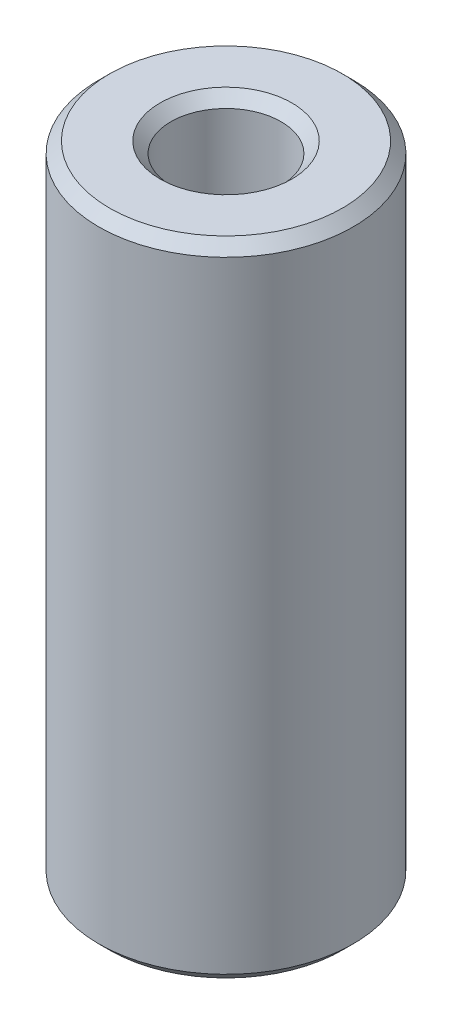
ISO-10303-21;
HEADER;
FILE_DESCRIPTION(('STEP AP214'),'2;1');
FILE_NAME('part.step','',(''),(''),'','','');
FILE_SCHEMA(('AUTOMOTIVE_DESIGN { 1 0 10303 214 1 1 1 1 }'));
ENDSEC;
DATA;
#1=APPLICATION_CONTEXT('core data for automotive mechanical design processes');
#2=APPLICATION_PROTOCOL_DEFINITION('international standard','automotive_design',2000,#1);
#3=PRODUCT_CONTEXT('',#1,'mechanical');
#4=PRODUCT('Part','Part','',(#3));
#5=PRODUCT_RELATED_PRODUCT_CATEGORY('part','',(#4));
#6=PRODUCT_DEFINITION_FORMATION('','',#4);
#7=PRODUCT_DEFINITION_CONTEXT('part definition',#1,'design');
#8=PRODUCT_DEFINITION('design','',#6,#7);
#9=PRODUCT_DEFINITION_SHAPE('','',#8);
#10=(LENGTH_UNIT() NAMED_UNIT(*) SI_UNIT(.MILLI.,.METRE.));
#11=(NAMED_UNIT(*) PLANE_ANGLE_UNIT() SI_UNIT($,.RADIAN.));
#12=(NAMED_UNIT(*) SI_UNIT($,.STERADIAN.) SOLID_ANGLE_UNIT());
#13=UNCERTAINTY_MEASURE_WITH_UNIT(LENGTH_MEASURE(1.E-05),#10,'distance_accuracy_value','');
#14=(GEOMETRIC_REPRESENTATION_CONTEXT(3) GLOBAL_UNCERTAINTY_ASSIGNED_CONTEXT((#13)) GLOBAL_UNIT_ASSIGNED_CONTEXT((#10,
#11,#12)) REPRESENTATION_CONTEXT('',''));
#15=CARTESIAN_POINT('',(0.,0.,0.));
#16=DIRECTION('',(0.,0.,1.));
#17=DIRECTION('',(1.,0.,0.));
#18=AXIS2_PLACEMENT_3D('',#15,#16,#17);
#19=CARTESIAN_POINT('',(0.,88.390727873785,0.));
#20=DIRECTION('',(0.,-1.,0.));
#21=DIRECTION('',(0.,0.,-1.));
#22=AXIS2_PLACEMENT_3D('',#19,#20,#21);
#23=CYLINDRICAL_SURFACE('',#22,17.5);
#24=CARTESIAN_POINT('',(0.,1.48932013609084,0.));
#25=DIRECTION('',(0.,1.,0.));
#26=DIRECTION('',(0.,0.,1.));
#27=AXIS2_PLACEMENT_3D('',#24,#25,#26);
#28=CIRCLE('',#27,17.5);
#29=CARTESIAN_POINT('',(0.,1.48932013609084,17.5));
#30=VERTEX_POINT('',#29);
#31=EDGE_CURVE('E10',#30,#30,#28,.T.);
#32=ORIENTED_EDGE('',*,*,#31,.T.);
#33=EDGE_LOOP('',(#32));
#34=FACE_BOUND('',#33,.T.);
#35=CARTESIAN_POINT('',(0.,86.9014077376941,0.));
#36=DIRECTION('',(0.,1.,0.));
#37=DIRECTION('',(0.,0.,1.));
#38=AXIS2_PLACEMENT_3D('',#35,#36,#37);
#39=CIRCLE('',#38,17.5);
#40=CARTESIAN_POINT('',(0.,86.9014077376941,17.5));
#41=VERTEX_POINT('',#40);
#42=EDGE_CURVE('E50',#41,#41,#39,.F.);
#43=ORIENTED_EDGE('',*,*,#42,.T.);
#44=EDGE_LOOP('',(#43));
#45=FACE_BOUND('',#44,.T.);
#46=ADVANCED_FACE('F39',(#34,#45),#23,.T.);
#47=CARTESIAN_POINT('',(0.,88.390727873785,0.));
#48=DIRECTION('',(0.,1.,0.));
#49=DIRECTION('',(0.,0.,1.));
#50=AXIS2_PLACEMENT_3D('',#47,#48,#49);
#51=PLANE('',#50);
#52=CARTESIAN_POINT('',(0.,88.390727873785,0.));
#53=DIRECTION('',(0.,1.,0.));
#54=DIRECTION('',(0.,0.,1.));
#55=AXIS2_PLACEMENT_3D('',#52,#53,#54);
#56=CIRCLE('',#55,9.07266561372118);
#57=CARTESIAN_POINT('',(0.,88.390727873785,9.07266561372118));
#58=VERTEX_POINT('',#57);
#59=EDGE_CURVE('E58',#58,#58,#56,.F.);
#60=ORIENTED_EDGE('',*,*,#59,.T.);
#61=EDGE_LOOP('',(#60));
#62=FACE_BOUND('',#61,.T.);
#63=CARTESIAN_POINT('',(0.,88.390727873785,0.));
#64=DIRECTION('',(0.,1.,0.));
#65=DIRECTION('',(0.,0.,1.));
#66=AXIS2_PLACEMENT_3D('',#63,#64,#65);
#67=CIRCLE('',#66,16.0106798639092);
#68=CARTESIAN_POINT('',(0.,88.390727873785,16.0106798639092));
#69=VERTEX_POINT('',#68);
#70=EDGE_CURVE('E61',#69,#69,#67,.T.);
#71=ORIENTED_EDGE('',*,*,#70,.T.);
#72=EDGE_LOOP('',(#71));
#73=FACE_BOUND('',#72,.T.);
#74=ADVANCED_FACE('F88',(#62,#73),#51,.T.);
#75=CARTESIAN_POINT('',(0.,0.,0.));
#76=DIRECTION('',(0.,1.,0.));
#77=DIRECTION('',(0.,0.,1.));
#78=AXIS2_PLACEMENT_3D('',#75,#76,#77);
#79=PLANE('',#78);
#80=CARTESIAN_POINT('',(0.,0.,0.));
#81=DIRECTION('',(0.,1.,0.));
#82=DIRECTION('',(0.,0.,1.));
#83=AXIS2_PLACEMENT_3D('',#80,#81,#82);
#84=CIRCLE('',#83,9.07266561372119);
#85=CARTESIAN_POINT('',(0.,0.,9.07266561372119));
#86=VERTEX_POINT('',#85);
#87=EDGE_CURVE('E51',#86,#86,#84,.T.);
#88=ORIENTED_EDGE('',*,*,#87,.T.);
#89=EDGE_LOOP('',(#88));
#90=FACE_BOUND('',#89,.T.);
#91=CARTESIAN_POINT('',(0.,0.,0.));
#92=DIRECTION('',(0.,1.,0.));
#93=DIRECTION('',(0.,0.,1.));
#94=AXIS2_PLACEMENT_3D('',#91,#92,#93);
#95=CIRCLE('',#94,16.0106798639092);
#96=CARTESIAN_POINT('',(0.,0.,16.0106798639092));
#97=VERTEX_POINT('',#96);
#98=EDGE_CURVE('E54',#97,#97,#95,.F.);
#99=ORIENTED_EDGE('',*,*,#98,.T.);
#100=EDGE_LOOP('',(#99));
#101=FACE_BOUND('',#100,.T.);
#102=ADVANCED_FACE('F83',(#90,#101),#79,.F.);
#103=CARTESIAN_POINT('',(0.,88.390727873785,0.));
#104=DIRECTION('',(0.,-1.,0.));
#105=DIRECTION('',(0.,0.,-1.));
#106=AXIS2_PLACEMENT_3D('',#103,#104,#105);
#107=CYLINDRICAL_SURFACE('',#106,7.58334547763034);
#108=CARTESIAN_POINT('',(0.,86.9014077376941,0.));
#109=DIRECTION('',(0.,1.,0.));
#110=DIRECTION('',(0.,0.,1.));
#111=AXIS2_PLACEMENT_3D('',#108,#109,#110);
#112=CIRCLE('',#111,7.58334547763034);
#113=CARTESIAN_POINT('',(0.,86.9014077376941,7.58334547763034));
#114=VERTEX_POINT('',#113);
#115=EDGE_CURVE('E67',#114,#114,#112,.T.);
#116=ORIENTED_EDGE('',*,*,#115,.T.);
#117=EDGE_LOOP('',(#116));
#118=FACE_BOUND('',#117,.T.);
#119=CARTESIAN_POINT('',(0.,1.48932013609088,0.));
#120=DIRECTION('',(0.,1.,0.));
#121=DIRECTION('',(0.,0.,1.));
#122=AXIS2_PLACEMENT_3D('',#119,#120,#121);
#123=CIRCLE('',#122,7.58334547763034);
#124=CARTESIAN_POINT('',(0.,1.48932013609088,7.58334547763034));
#125=VERTEX_POINT('',#124);
#126=EDGE_CURVE('E69',#125,#125,#123,.F.);
#127=ORIENTED_EDGE('',*,*,#126,.T.);
#128=EDGE_LOOP('',(#127));
#129=FACE_BOUND('',#128,.T.);
#130=ADVANCED_FACE('F71',(#118,#129),#107,.F.);
#131=CARTESIAN_POINT('',(0.,86.9014077376941,0.));
#132=DIRECTION('',(0.,1.,0.));
#133=DIRECTION('',(0.,0.,1.));
#134=AXIS2_PLACEMENT_3D('',#131,#132,#133);
#135=CONICAL_SURFACE('',#134,7.58334547763034,0.78539816339745);
#136=ORIENTED_EDGE('',*,*,#59,.F.);
#137=EDGE_LOOP('',(#136));
#138=FACE_BOUND('',#137,.T.);
#139=ORIENTED_EDGE('',*,*,#115,.F.);
#140=EDGE_LOOP('',(#139));
#141=FACE_BOUND('',#140,.T.);
#142=ADVANCED_FACE('F77',(#138,#141),#135,.F.);
#143=CARTESIAN_POINT('',(0.,0.,0.));
#144=DIRECTION('',(0.,-1.,0.));
#145=DIRECTION('',(0.,0.,-1.));
#146=AXIS2_PLACEMENT_3D('',#143,#144,#145);
#147=CONICAL_SURFACE('',#146,9.07266561372119,0.785398163397441);
#148=ORIENTED_EDGE('',*,*,#126,.F.);
#149=EDGE_LOOP('',(#148));
#150=FACE_BOUND('',#149,.T.);
#151=ORIENTED_EDGE('',*,*,#87,.F.);
#152=EDGE_LOOP('',(#151));
#153=FACE_BOUND('',#152,.T.);
#154=ADVANCED_FACE('F73',(#150,#153),#147,.F.);
#155=CARTESIAN_POINT('',(0.,1.48932013609084,0.));
#156=DIRECTION('',(0.,1.,0.));
#157=DIRECTION('',(0.,0.,1.));
#158=AXIS2_PLACEMENT_3D('',#155,#156,#157);
#159=CONICAL_SURFACE('',#158,17.5,0.785398163397452);
#160=ORIENTED_EDGE('',*,*,#98,.F.);
#161=EDGE_LOOP('',(#160));
#162=FACE_BOUND('',#161,.T.);
#163=ORIENTED_EDGE('',*,*,#31,.F.);
#164=EDGE_LOOP('',(#163));
#165=FACE_BOUND('',#164,.T.);
#166=ADVANCED_FACE('F76',(#162,#165),#159,.T.);
#167=CARTESIAN_POINT('',(0.,88.390727873785,0.));
#168=DIRECTION('',(0.,-1.,0.));
#169=DIRECTION('',(0.,0.,-1.));
#170=AXIS2_PLACEMENT_3D('',#167,#168,#169);
#171=CONICAL_SURFACE('',#170,16.0106798639092,0.785398163397445);
#172=ORIENTED_EDGE('',*,*,#42,.F.);
#173=EDGE_LOOP('',(#172));
#174=FACE_BOUND('',#173,.T.);
#175=ORIENTED_EDGE('',*,*,#70,.F.);
#176=EDGE_LOOP('',(#175));
#177=FACE_BOUND('',#176,.T.);
#178=ADVANCED_FACE('F45',(#174,#177),#171,.T.);
#179=CLOSED_SHELL('',(#46,#74,#102,#130,#142,#154,#166,#178));
#180=MANIFOLD_SOLID_BREP('B2',#179);
#181=ADVANCED_BREP_SHAPE_REPRESENTATION('',(#18,#180),#14);
#182=SHAPE_DEFINITION_REPRESENTATION(#9,#181);
ENDSEC;
END-ISO-10303-21;
